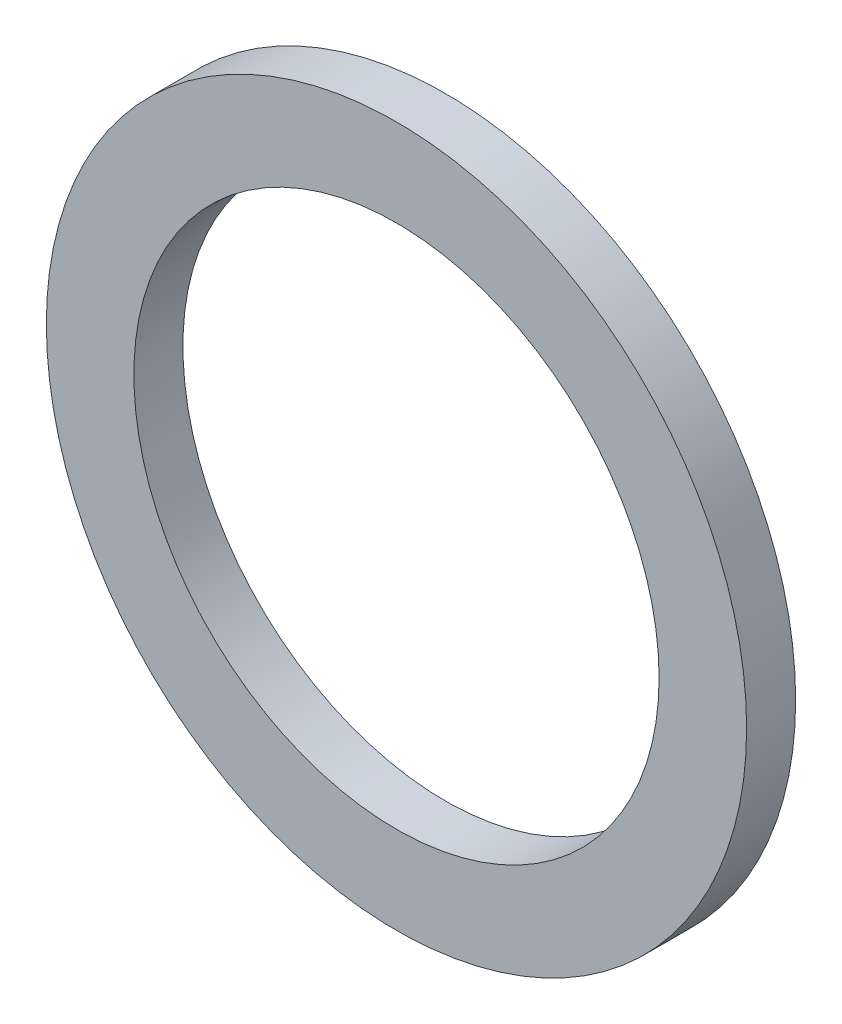
ISO-10303-21;
HEADER;
FILE_DESCRIPTION(('STEP AP214'),'2;1');
FILE_NAME('part.step','',(''),(''),'','','');
FILE_SCHEMA(('AUTOMOTIVE_DESIGN { 1 0 10303 214 1 1 1 1 }'));
ENDSEC;
DATA;
#1=APPLICATION_CONTEXT('core data for automotive mechanical design processes');
#2=APPLICATION_PROTOCOL_DEFINITION('international standard','automotive_design',2000,#1);
#3=PRODUCT_CONTEXT('',#1,'mechanical');
#4=PRODUCT('Part','Part','',(#3));
#5=PRODUCT_RELATED_PRODUCT_CATEGORY('part','',(#4));
#6=PRODUCT_DEFINITION_FORMATION('','',#4);
#7=PRODUCT_DEFINITION_CONTEXT('part definition',#1,'design');
#8=PRODUCT_DEFINITION('design','',#6,#7);
#9=PRODUCT_DEFINITION_SHAPE('','',#8);
#10=(LENGTH_UNIT() NAMED_UNIT(*) SI_UNIT(.MILLI.,.METRE.));
#11=(NAMED_UNIT(*) PLANE_ANGLE_UNIT() SI_UNIT($,.RADIAN.));
#12=(NAMED_UNIT(*) SI_UNIT($,.STERADIAN.) SOLID_ANGLE_UNIT());
#13=UNCERTAINTY_MEASURE_WITH_UNIT(LENGTH_MEASURE(1.E-05),#10,'distance_accuracy_value','');
#14=(GEOMETRIC_REPRESENTATION_CONTEXT(3) GLOBAL_UNCERTAINTY_ASSIGNED_CONTEXT((#13)) GLOBAL_UNIT_ASSIGNED_CONTEXT((#10,
#11,#12)) REPRESENTATION_CONTEXT('',''));
#15=CARTESIAN_POINT('',(0.,0.,0.));
#16=DIRECTION('',(0.,0.,1.));
#17=DIRECTION('',(1.,0.,0.));
#18=AXIS2_PLACEMENT_3D('',#15,#16,#17);
#19=CARTESIAN_POINT('',(0.,0.,1.778));
#20=DIRECTION('',(0.,0.,1.));
#21=DIRECTION('',(1.,0.,0.));
#22=AXIS2_PLACEMENT_3D('',#19,#20,#21);
#23=PLANE('',#22);
#24=CARTESIAN_POINT('',(0.,0.,1.778));
#25=DIRECTION('',(0.,0.,1.));
#26=DIRECTION('',(1.,0.,0.));
#27=AXIS2_PLACEMENT_3D('',#24,#25,#26);
#28=CIRCLE('',#27,12.7);
#29=CARTESIAN_POINT('',(12.7,0.,1.778));
#30=VERTEX_POINT('',#29);
#31=EDGE_CURVE('E10',#30,#30,#28,.T.);
#32=ORIENTED_EDGE('',*,*,#31,.T.);
#33=EDGE_LOOP('',(#32));
#34=FACE_BOUND('',#33,.T.);
#35=CARTESIAN_POINT('',(0.,0.,1.778));
#36=DIRECTION('',(0.,0.,1.));
#37=DIRECTION('',(1.,0.,0.));
#38=AXIS2_PLACEMENT_3D('',#35,#36,#37);
#39=CIRCLE('',#38,9.525);
#40=CARTESIAN_POINT('',(9.525,0.,1.778));
#41=VERTEX_POINT('',#40);
#42=EDGE_CURVE('E42',#41,#41,#39,.T.);
#43=ORIENTED_EDGE('',*,*,#42,.F.);
#44=EDGE_LOOP('',(#43));
#45=FACE_BOUND('',#44,.T.);
#46=ADVANCED_FACE('F31',(#34,#45),#23,.T.);
#47=CARTESIAN_POINT('',(0.,0.,0.));
#48=DIRECTION('',(0.,0.,1.));
#49=DIRECTION('',(1.,0.,0.));
#50=AXIS2_PLACEMENT_3D('',#47,#48,#49);
#51=PLANE('',#50);
#52=CARTESIAN_POINT('',(0.,0.,0.));
#53=DIRECTION('',(0.,0.,1.));
#54=DIRECTION('',(1.,0.,0.));
#55=AXIS2_PLACEMENT_3D('',#52,#53,#54);
#56=CIRCLE('',#55,12.7);
#57=CARTESIAN_POINT('',(12.7,0.,0.));
#58=VERTEX_POINT('',#57);
#59=EDGE_CURVE('E35',#58,#58,#56,.T.);
#60=ORIENTED_EDGE('',*,*,#59,.F.);
#61=EDGE_LOOP('',(#60));
#62=FACE_BOUND('',#61,.T.);
#63=CARTESIAN_POINT('',(0.,0.,0.));
#64=DIRECTION('',(0.,0.,1.));
#65=DIRECTION('',(1.,0.,0.));
#66=AXIS2_PLACEMENT_3D('',#63,#64,#65);
#67=CIRCLE('',#66,9.525);
#68=CARTESIAN_POINT('',(9.525,0.,0.));
#69=VERTEX_POINT('',#68);
#70=EDGE_CURVE('E44',#69,#69,#67,.T.);
#71=ORIENTED_EDGE('',*,*,#70,.T.);
#72=EDGE_LOOP('',(#71));
#73=FACE_BOUND('',#72,.T.);
#74=ADVANCED_FACE('F54',(#62,#73),#51,.F.);
#75=CARTESIAN_POINT('',(0.,0.,1.778));
#76=DIRECTION('',(0.,0.,-1.));
#77=DIRECTION('',(-1.,0.,0.));
#78=AXIS2_PLACEMENT_3D('',#75,#76,#77);
#79=CYLINDRICAL_SURFACE('',#78,12.7);
#80=ORIENTED_EDGE('',*,*,#31,.F.);
#81=EDGE_LOOP('',(#80));
#82=FACE_BOUND('',#81,.T.);
#83=ORIENTED_EDGE('',*,*,#59,.T.);
#84=EDGE_LOOP('',(#83));
#85=FACE_BOUND('',#84,.T.);
#86=ADVANCED_FACE('F33',(#82,#85),#79,.T.);
#87=CARTESIAN_POINT('',(0.,0.,1.778));
#88=DIRECTION('',(0.,0.,-1.));
#89=DIRECTION('',(-1.,0.,0.));
#90=AXIS2_PLACEMENT_3D('',#87,#88,#89);
#91=CYLINDRICAL_SURFACE('',#90,9.525);
#92=ORIENTED_EDGE('',*,*,#42,.T.);
#93=EDGE_LOOP('',(#92));
#94=FACE_BOUND('',#93,.T.);
#95=ORIENTED_EDGE('',*,*,#70,.F.);
#96=EDGE_LOOP('',(#95));
#97=FACE_BOUND('',#96,.T.);
#98=ADVANCED_FACE('F50',(#94,#97),#91,.F.);
#99=CLOSED_SHELL('',(#46,#74,#86,#98));
#100=MANIFOLD_SOLID_BREP('B2',#99);
#101=ADVANCED_BREP_SHAPE_REPRESENTATION('',(#18,#100),#14);
#102=SHAPE_DEFINITION_REPRESENTATION(#9,#101);
ENDSEC;
END-ISO-10303-21;
